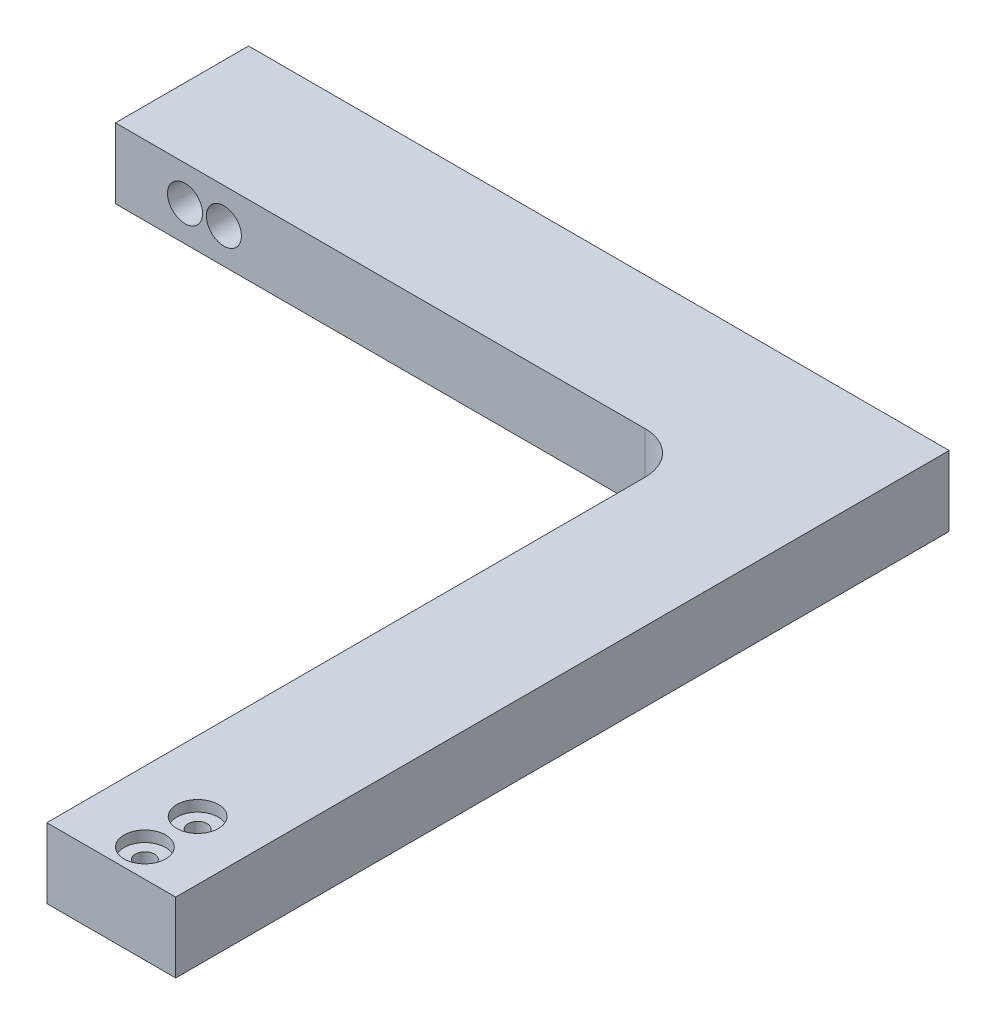
ISO-10303-21;
HEADER;
FILE_DESCRIPTION(('STEP AP214'),'2;1');
FILE_NAME('part.step','',(''),(''),'','','');
FILE_SCHEMA(('AUTOMOTIVE_DESIGN { 1 0 10303 214 1 1 1 1 }'));
ENDSEC;
DATA;
#1=APPLICATION_CONTEXT('core data for automotive mechanical design processes');
#2=APPLICATION_PROTOCOL_DEFINITION('international standard','automotive_design',2000,#1);
#3=PRODUCT_CONTEXT('',#1,'mechanical');
#4=PRODUCT('Part','Part','',(#3));
#5=PRODUCT_RELATED_PRODUCT_CATEGORY('part','',(#4));
#6=PRODUCT_DEFINITION_FORMATION('','',#4);
#7=PRODUCT_DEFINITION_CONTEXT('part definition',#1,'design');
#8=PRODUCT_DEFINITION('design','',#6,#7);
#9=PRODUCT_DEFINITION_SHAPE('','',#8);
#10=(LENGTH_UNIT() NAMED_UNIT(*) SI_UNIT(.MILLI.,.METRE.));
#11=(NAMED_UNIT(*) PLANE_ANGLE_UNIT() SI_UNIT($,.RADIAN.));
#12=(NAMED_UNIT(*) SI_UNIT($,.STERADIAN.) SOLID_ANGLE_UNIT());
#13=UNCERTAINTY_MEASURE_WITH_UNIT(LENGTH_MEASURE(1.E-05),#10,'distance_accuracy_value','');
#14=(GEOMETRIC_REPRESENTATION_CONTEXT(3) GLOBAL_UNCERTAINTY_ASSIGNED_CONTEXT((#13)) GLOBAL_UNIT_ASSIGNED_CONTEXT((#10,
#11,#12)) REPRESENTATION_CONTEXT('',''));
#15=CARTESIAN_POINT('',(0.,0.,0.));
#16=DIRECTION('',(0.,0.,1.));
#17=DIRECTION('',(1.,0.,0.));
#18=AXIS2_PLACEMENT_3D('',#15,#16,#17);
#19=CARTESIAN_POINT('',(10.668,12.7,-64.008));
#20=DIRECTION('',(-1.,0.,0.));
#21=DIRECTION('',(0.,0.,1.));
#22=AXIS2_PLACEMENT_3D('',#19,#20,#21);
#23=PLANE('',#22);
#24=DIRECTION('',(0.,0.,-1.));
#25=VECTOR('',#24,1.);
#26=CARTESIAN_POINT('',(10.668,0.,-64.008));
#27=LINE('',#26,#25);
#28=CARTESIAN_POINT('',(10.668,0.,76.2000000000001));
#29=VERTEX_POINT('',#28);
#30=CARTESIAN_POINT('',(10.668,0.,-64.008));
#31=VERTEX_POINT('',#30);
#32=EDGE_CURVE('E115',#29,#31,#27,.T.);
#33=ORIENTED_EDGE('',*,*,#32,.T.);
#34=DIRECTION('',(0.,-1.,0.));
#35=VECTOR('',#34,1.);
#36=CARTESIAN_POINT('',(10.668,12.7,-64.008));
#37=LINE('',#36,#35);
#38=CARTESIAN_POINT('',(10.668,12.7,-64.008));
#39=VERTEX_POINT('',#38);
#40=EDGE_CURVE('E96',#39,#31,#37,.T.);
#41=ORIENTED_EDGE('',*,*,#40,.F.);
#42=DIRECTION('',(0.,0.,-1.));
#43=VECTOR('',#42,1.);
#44=CARTESIAN_POINT('',(10.668,12.7,-64.008));
#45=LINE('',#44,#43);
#46=CARTESIAN_POINT('',(10.668,12.7,76.2000000000001));
#47=VERTEX_POINT('',#46);
#48=EDGE_CURVE('E103',#47,#39,#45,.T.);
#49=ORIENTED_EDGE('',*,*,#48,.F.);
#50=DIRECTION('',(0.,-1.,0.));
#51=VECTOR('',#50,1.);
#52=CARTESIAN_POINT('',(10.668,12.7,76.2000000000001));
#53=LINE('',#52,#51);
#54=EDGE_CURVE('E129',#47,#29,#53,.T.);
#55=ORIENTED_EDGE('',*,*,#54,.T.);
#56=EDGE_LOOP('',(#33,#41,#49,#55));
#57=FACE_BOUND('',#56,.T.);
#58=ADVANCED_FACE('F33',(#57),#23,.F.);
#59=CARTESIAN_POINT('',(10.668,12.7,-64.008));
#60=DIRECTION('',(0.,0.,1.));
#61=DIRECTION('',(1.,0.,0.));
#62=AXIS2_PLACEMENT_3D('',#59,#60,#61);
#63=PLANE('',#62);
#64=CARTESIAN_POINT('',(-103.71820388725,6.35,-64.008));
#65=DIRECTION('',(0.,0.,-1.));
#66=DIRECTION('',(-1.,0.,0.));
#67=AXIS2_PLACEMENT_3D('',#64,#65,#66);
#68=CIRCLE('',#67,3.17499999999998);
#69=CARTESIAN_POINT('',(-106.89320388725,6.35,-64.008));
#70=VERTEX_POINT('',#69);
#71=EDGE_CURVE('E180',#70,#70,#68,.T.);
#72=ORIENTED_EDGE('',*,*,#71,.F.);
#73=EDGE_LOOP('',(#72));
#74=FACE_BOUND('',#73,.T.);
#75=CARTESIAN_POINT('',(-96.6727548070736,6.35,-64.008));
#76=DIRECTION('',(0.,0.,-1.));
#77=DIRECTION('',(-1.,0.,0.));
#78=AXIS2_PLACEMENT_3D('',#75,#76,#77);
#79=CIRCLE('',#78,3.17499999999998);
#80=CARTESIAN_POINT('',(-99.8477548070736,6.35,-64.008));
#81=VERTEX_POINT('',#80);
#82=EDGE_CURVE('E174',#81,#81,#79,.T.);
#83=ORIENTED_EDGE('',*,*,#82,.F.);
#84=EDGE_LOOP('',(#83));
#85=FACE_BOUND('',#84,.T.);
#86=DIRECTION('',(-1.,0.,0.));
#87=VECTOR('',#86,1.);
#88=CARTESIAN_POINT('',(10.668,0.,-64.008));
#89=LINE('',#88,#87);
#90=CARTESIAN_POINT('',(-116.332,0.,-64.008));
#91=VERTEX_POINT('',#90);
#92=EDGE_CURVE('E138',#31,#91,#89,.T.);
#93=ORIENTED_EDGE('',*,*,#92,.T.);
#94=DIRECTION('',(0.,-1.,0.));
#95=VECTOR('',#94,1.);
#96=CARTESIAN_POINT('',(-116.332,12.7,-64.008));
#97=LINE('',#96,#95);
#98=CARTESIAN_POINT('',(-116.332,12.7,-64.008));
#99=VERTEX_POINT('',#98);
#100=EDGE_CURVE('E99',#99,#91,#97,.T.);
#101=ORIENTED_EDGE('',*,*,#100,.F.);
#102=DIRECTION('',(-1.,0.,0.));
#103=VECTOR('',#102,1.);
#104=CARTESIAN_POINT('',(10.668,12.7,-64.008));
#105=LINE('',#104,#103);
#106=EDGE_CURVE('E92',#39,#99,#105,.T.);
#107=ORIENTED_EDGE('',*,*,#106,.F.);
#108=ORIENTED_EDGE('',*,*,#40,.T.);
#109=EDGE_LOOP('',(#93,#101,#107,#108));
#110=FACE_BOUND('',#109,.T.);
#111=ADVANCED_FACE('F94',(#74,#85,#110),#63,.F.);
#112=CARTESIAN_POINT('',(-116.332,12.7,-64.008));
#113=DIRECTION('',(1.,0.,0.));
#114=DIRECTION('',(0.,0.,-1.));
#115=AXIS2_PLACEMENT_3D('',#112,#113,#114);
#116=PLANE('',#115);
#117=DIRECTION('',(0.,0.,1.));
#118=VECTOR('',#117,1.);
#119=CARTESIAN_POINT('',(-116.332,0.,-64.008));
#120=LINE('',#119,#118);
#121=CARTESIAN_POINT('',(-116.332,0.,-39.878));
#122=VERTEX_POINT('',#121);
#123=EDGE_CURVE('E136',#91,#122,#120,.T.);
#124=ORIENTED_EDGE('',*,*,#123,.T.);
#125=DIRECTION('',(0.,-1.,0.));
#126=VECTOR('',#125,1.);
#127=CARTESIAN_POINT('',(-116.332,12.7,-39.878));
#128=LINE('',#127,#126);
#129=CARTESIAN_POINT('',(-116.332,12.7,-39.878));
#130=VERTEX_POINT('',#129);
#131=EDGE_CURVE('E120',#130,#122,#128,.T.);
#132=ORIENTED_EDGE('',*,*,#131,.F.);
#133=DIRECTION('',(0.,0.,1.));
#134=VECTOR('',#133,1.);
#135=CARTESIAN_POINT('',(-116.332,12.7,-64.008));
#136=LINE('',#135,#134);
#137=EDGE_CURVE('E102',#99,#130,#136,.T.);
#138=ORIENTED_EDGE('',*,*,#137,.F.);
#139=ORIENTED_EDGE('',*,*,#100,.T.);
#140=EDGE_LOOP('',(#124,#132,#138,#139));
#141=FACE_BOUND('',#140,.T.);
#142=ADVANCED_FACE('F188',(#141),#116,.F.);
#143=CARTESIAN_POINT('',(-12.7,12.7,-39.878));
#144=DIRECTION('',(0.,0.,-1.));
#145=DIRECTION('',(-1.,0.,0.));
#146=AXIS2_PLACEMENT_3D('',#143,#144,#145);
#147=PLANE('',#146);
#148=CARTESIAN_POINT('',(-103.71820388725,6.35,-39.878));
#149=DIRECTION('',(0.,0.,-1.));
#150=DIRECTION('',(-1.,0.,0.));
#151=AXIS2_PLACEMENT_3D('',#148,#149,#150);
#152=CIRCLE('',#151,3.17499999999999);
#153=CARTESIAN_POINT('',(-106.89320388725,6.35,-39.878));
#154=VERTEX_POINT('',#153);
#155=EDGE_CURVE('E177',#154,#154,#152,.T.);
#156=ORIENTED_EDGE('',*,*,#155,.T.);
#157=EDGE_LOOP('',(#156));
#158=FACE_BOUND('',#157,.T.);
#159=CARTESIAN_POINT('',(-96.6727548070736,6.35,-39.878));
#160=DIRECTION('',(0.,0.,-1.));
#161=DIRECTION('',(-1.,0.,0.));
#162=AXIS2_PLACEMENT_3D('',#159,#160,#161);
#163=CIRCLE('',#162,3.17499999999999);
#164=CARTESIAN_POINT('',(-99.8477548070736,6.35,-39.878));
#165=VERTEX_POINT('',#164);
#166=EDGE_CURVE('E171',#165,#165,#163,.T.);
#167=ORIENTED_EDGE('',*,*,#166,.T.);
#168=EDGE_LOOP('',(#167));
#169=FACE_BOUND('',#168,.T.);
#170=DIRECTION('',(1.,0.,0.));
#171=VECTOR('',#170,1.);
#172=CARTESIAN_POINT('',(-12.7,0.,-39.878));
#173=LINE('',#172,#171);
#174=CARTESIAN_POINT('',(-20.32,0.,-39.878));
#175=VERTEX_POINT('',#174);
#176=EDGE_CURVE('E134',#122,#175,#173,.T.);
#177=ORIENTED_EDGE('',*,*,#176,.T.);
#178=DIRECTION('',(0.,-1.,0.));
#179=VECTOR('',#178,1.);
#180=CARTESIAN_POINT('',(-20.32,12.7,-39.878));
#181=LINE('',#180,#179);
#182=CARTESIAN_POINT('',(-20.32,12.7,-39.878));
#183=VERTEX_POINT('',#182);
#184=EDGE_CURVE('E48',#175,#183,#181,.F.);
#185=ORIENTED_EDGE('',*,*,#184,.T.);
#186=DIRECTION('',(1.,0.,0.));
#187=VECTOR('',#186,1.);
#188=CARTESIAN_POINT('',(-12.7,12.7,-39.878));
#189=LINE('',#188,#187);
#190=EDGE_CURVE('E145',#130,#183,#189,.T.);
#191=ORIENTED_EDGE('',*,*,#190,.F.);
#192=ORIENTED_EDGE('',*,*,#131,.T.);
#193=EDGE_LOOP('',(#177,#185,#191,#192));
#194=FACE_BOUND('',#193,.T.);
#195=ADVANCED_FACE('F213',(#158,#169,#194),#147,.F.);
#196=CARTESIAN_POINT('',(-12.7,12.7,-39.878));
#197=DIRECTION('',(1.,0.,0.));
#198=DIRECTION('',(0.,0.,-1.));
#199=AXIS2_PLACEMENT_3D('',#196,#197,#198);
#200=PLANE('',#199);
#201=DIRECTION('',(0.,0.,1.));
#202=VECTOR('',#201,1.);
#203=CARTESIAN_POINT('',(-12.7,12.7,-39.878));
#204=LINE('',#203,#202);
#205=CARTESIAN_POINT('',(-12.7,12.7,-32.258));
#206=VERTEX_POINT('',#205);
#207=CARTESIAN_POINT('',(-12.7,12.7,76.2000000000001));
#208=VERTEX_POINT('',#207);
#209=EDGE_CURVE('E143',#206,#208,#204,.T.);
#210=ORIENTED_EDGE('',*,*,#209,.F.);
#211=DIRECTION('',(0.,-1.,0.));
#212=VECTOR('',#211,1.);
#213=CARTESIAN_POINT('',(-12.7,0.,-32.258));
#214=LINE('',#213,#212);
#215=CARTESIAN_POINT('',(-12.7,0.,-32.258));
#216=VERTEX_POINT('',#215);
#217=EDGE_CURVE('E116',#206,#216,#214,.T.);
#218=ORIENTED_EDGE('',*,*,#217,.T.);
#219=DIRECTION('',(0.,0.,1.));
#220=VECTOR('',#219,1.);
#221=CARTESIAN_POINT('',(-12.7,0.,-39.878));
#222=LINE('',#221,#220);
#223=CARTESIAN_POINT('',(-12.7,0.,76.2000000000001));
#224=VERTEX_POINT('',#223);
#225=EDGE_CURVE('E132',#216,#224,#222,.T.);
#226=ORIENTED_EDGE('',*,*,#225,.T.);
#227=DIRECTION('',(0.,-1.,0.));
#228=VECTOR('',#227,1.);
#229=CARTESIAN_POINT('',(-12.7,12.7,76.2000000000001));
#230=LINE('',#229,#228);
#231=EDGE_CURVE('E126',#208,#224,#230,.T.);
#232=ORIENTED_EDGE('',*,*,#231,.F.);
#233=EDGE_LOOP('',(#210,#218,#226,#232));
#234=FACE_BOUND('',#233,.T.);
#235=ADVANCED_FACE('F217',(#234),#200,.F.);
#236=CARTESIAN_POINT('',(-12.7,12.7,76.2000000000001));
#237=DIRECTION('',(0.,0.,-1.));
#238=DIRECTION('',(-1.,0.,0.));
#239=AXIS2_PLACEMENT_3D('',#236,#237,#238);
#240=PLANE('',#239);
#241=DIRECTION('',(1.,0.,0.));
#242=VECTOR('',#241,1.);
#243=CARTESIAN_POINT('',(-12.7,0.,76.2000000000001));
#244=LINE('',#243,#242);
#245=EDGE_CURVE('E112',#224,#29,#244,.T.);
#246=ORIENTED_EDGE('',*,*,#245,.T.);
#247=ORIENTED_EDGE('',*,*,#54,.F.);
#248=DIRECTION('',(1.,0.,0.));
#249=VECTOR('',#248,1.);
#250=CARTESIAN_POINT('',(-12.7,12.7,76.2000000000001));
#251=LINE('',#250,#249);
#252=EDGE_CURVE('E108',#208,#47,#251,.T.);
#253=ORIENTED_EDGE('',*,*,#252,.F.);
#254=ORIENTED_EDGE('',*,*,#231,.T.);
#255=EDGE_LOOP('',(#246,#247,#253,#254));
#256=FACE_BOUND('',#255,.T.);
#257=ADVANCED_FACE('F221',(#256),#240,.F.);
#258=CARTESIAN_POINT('',(0.,12.7,0.));
#259=DIRECTION('',(0.,1.,0.));
#260=DIRECTION('',(0.,0.,1.));
#261=AXIS2_PLACEMENT_3D('',#258,#259,#260);
#262=PLANE('',#261);
#263=CARTESIAN_POINT('',(0.,12.7,71.1200000000001));
#264=DIRECTION('',(0.,1.,0.));
#265=DIRECTION('',(0.,0.,1.));
#266=AXIS2_PLACEMENT_3D('',#263,#264,#265);
#267=CIRCLE('',#266,3.77063);
#268=CARTESIAN_POINT('',(0.,12.7,74.8906300000001));
#269=VERTEX_POINT('',#268);
#270=EDGE_CURVE('E168',#269,#269,#267,.T.);
#271=ORIENTED_EDGE('',*,*,#270,.F.);
#272=EDGE_LOOP('',(#271));
#273=FACE_BOUND('',#272,.T.);
#274=CARTESIAN_POINT('',(0.,12.7,61.5608905791934));
#275=DIRECTION('',(0.,1.,0.));
#276=DIRECTION('',(0.,0.,1.));
#277=AXIS2_PLACEMENT_3D('',#274,#275,#276);
#278=CIRCLE('',#277,3.77063);
#279=CARTESIAN_POINT('',(0.,12.7,65.3315205791934));
#280=VERTEX_POINT('',#279);
#281=EDGE_CURVE('E156',#280,#280,#278,.T.);
#282=ORIENTED_EDGE('',*,*,#281,.F.);
#283=EDGE_LOOP('',(#282));
#284=FACE_BOUND('',#283,.T.);
#285=ORIENTED_EDGE('',*,*,#48,.T.);
#286=ORIENTED_EDGE('',*,*,#106,.T.);
#287=ORIENTED_EDGE('',*,*,#137,.T.);
#288=ORIENTED_EDGE('',*,*,#190,.T.);
#289=CARTESIAN_POINT('',(-20.32,12.7,-32.258));
#290=DIRECTION('',(0.,1.,0.));
#291=DIRECTION('',(0.,0.,1.));
#292=AXIS2_PLACEMENT_3D('',#289,#290,#291);
#293=CIRCLE('',#292,7.62);
#294=EDGE_CURVE('E11',#183,#206,#293,.F.);
#295=ORIENTED_EDGE('',*,*,#294,.T.);
#296=ORIENTED_EDGE('',*,*,#209,.T.);
#297=ORIENTED_EDGE('',*,*,#252,.T.);
#298=EDGE_LOOP('',(#285,#286,#287,#288,#295,#296,#297));
#299=FACE_BOUND('',#298,.T.);
#300=ADVANCED_FACE('F106',(#273,#284,#299),#262,.T.);
#301=CARTESIAN_POINT('',(0.,0.,0.));
#302=DIRECTION('',(0.,1.,0.));
#303=DIRECTION('',(0.,0.,1.));
#304=AXIS2_PLACEMENT_3D('',#301,#302,#303);
#305=PLANE('',#304);
#306=CARTESIAN_POINT('',(0.,0.,71.1200000000001));
#307=DIRECTION('',(0.,1.,0.));
#308=DIRECTION('',(0.,0.,1.));
#309=AXIS2_PLACEMENT_3D('',#306,#307,#308);
#310=CIRCLE('',#309,1.7272);
#311=CARTESIAN_POINT('',(0.,0.,72.8472000000001));
#312=VERTEX_POINT('',#311);
#313=EDGE_CURVE('E159',#312,#312,#310,.T.);
#314=ORIENTED_EDGE('',*,*,#313,.T.);
#315=EDGE_LOOP('',(#314));
#316=FACE_BOUND('',#315,.T.);
#317=CARTESIAN_POINT('',(0.,0.,61.5608905791934));
#318=DIRECTION('',(0.,1.,0.));
#319=DIRECTION('',(0.,0.,1.));
#320=AXIS2_PLACEMENT_3D('',#317,#318,#319);
#321=CIRCLE('',#320,1.7272);
#322=CARTESIAN_POINT('',(0.,0.,63.2880905791934));
#323=VERTEX_POINT('',#322);
#324=EDGE_CURVE('E141',#323,#323,#321,.T.);
#325=ORIENTED_EDGE('',*,*,#324,.T.);
#326=EDGE_LOOP('',(#325));
#327=FACE_BOUND('',#326,.T.);
#328=ORIENTED_EDGE('',*,*,#32,.F.);
#329=ORIENTED_EDGE('',*,*,#245,.F.);
#330=ORIENTED_EDGE('',*,*,#225,.F.);
#331=CARTESIAN_POINT('',(-20.32,0.,-32.258));
#332=DIRECTION('',(0.,1.,0.));
#333=DIRECTION('',(0.,0.,1.));
#334=AXIS2_PLACEMENT_3D('',#331,#332,#333);
#335=CIRCLE('',#334,7.62);
#336=EDGE_CURVE('E41',#216,#175,#335,.T.);
#337=ORIENTED_EDGE('',*,*,#336,.T.);
#338=ORIENTED_EDGE('',*,*,#176,.F.);
#339=ORIENTED_EDGE('',*,*,#123,.F.);
#340=ORIENTED_EDGE('',*,*,#92,.F.);
#341=EDGE_LOOP('',(#328,#329,#330,#337,#338,#339,#340));
#342=FACE_BOUND('',#341,.T.);
#343=ADVANCED_FACE('F226',(#316,#327,#342),#305,.F.);
#344=CARTESIAN_POINT('',(-20.32,12.7,-32.258));
#345=DIRECTION('',(0.,1.,0.));
#346=DIRECTION('',(0.,0.,1.));
#347=AXIS2_PLACEMENT_3D('',#344,#345,#346);
#348=CYLINDRICAL_SURFACE('',#347,7.62);
#349=ORIENTED_EDGE('',*,*,#294,.F.);
#350=ORIENTED_EDGE('',*,*,#184,.F.);
#351=ORIENTED_EDGE('',*,*,#336,.F.);
#352=ORIENTED_EDGE('',*,*,#217,.F.);
#353=EDGE_LOOP('',(#349,#350,#351,#352));
#354=FACE_BOUND('',#353,.T.);
#355=ADVANCED_FACE('F35',(#354),#348,.F.);
#356=CARTESIAN_POINT('',(0.,12.7,61.5608905791934));
#357=DIRECTION('',(0.,1.,0.));
#358=DIRECTION('',(0.,0.,1.));
#359=AXIS2_PLACEMENT_3D('',#356,#357,#358);
#360=CYLINDRICAL_SURFACE('',#359,1.7272);
#361=ORIENTED_EDGE('',*,*,#324,.F.);
#362=EDGE_LOOP('',(#361));
#363=FACE_BOUND('',#362,.T.);
#364=CARTESIAN_POINT('',(0.,10.7188,61.5608905791934));
#365=DIRECTION('',(0.,1.,0.));
#366=DIRECTION('',(0.,0.,1.));
#367=AXIS2_PLACEMENT_3D('',#364,#365,#366);
#368=CIRCLE('',#367,1.7272);
#369=CARTESIAN_POINT('',(0.,10.7188,63.2880905791934));
#370=VERTEX_POINT('',#369);
#371=EDGE_CURVE('E150',#370,#370,#368,.T.);
#372=ORIENTED_EDGE('',*,*,#371,.T.);
#373=EDGE_LOOP('',(#372));
#374=FACE_BOUND('',#373,.T.);
#375=ADVANCED_FACE('F233',(#363,#374),#360,.F.);
#376=CARTESIAN_POINT('',(1.7272,10.7188,61.5608905791934));
#377=DIRECTION('',(0.,-1.,0.));
#378=DIRECTION('',(0.,0.,-1.));
#379=AXIS2_PLACEMENT_3D('',#376,#377,#378);
#380=PLANE('',#379);
#381=ORIENTED_EDGE('',*,*,#371,.F.);
#382=EDGE_LOOP('',(#381));
#383=FACE_BOUND('',#382,.T.);
#384=CARTESIAN_POINT('',(0.,10.7188,61.5608905791934));
#385=DIRECTION('',(0.,1.,0.));
#386=DIRECTION('',(0.,0.,1.));
#387=AXIS2_PLACEMENT_3D('',#384,#385,#386);
#388=CIRCLE('',#387,3.77063);
#389=CARTESIAN_POINT('',(0.,10.7188,65.3315205791934));
#390=VERTEX_POINT('',#389);
#391=EDGE_CURVE('E153',#390,#390,#388,.T.);
#392=ORIENTED_EDGE('',*,*,#391,.T.);
#393=EDGE_LOOP('',(#392));
#394=FACE_BOUND('',#393,.T.);
#395=ADVANCED_FACE('F236',(#383,#394),#380,.F.);
#396=CARTESIAN_POINT('',(0.,12.7,61.5608905791934));
#397=DIRECTION('',(0.,1.,0.));
#398=DIRECTION('',(0.,0.,1.));
#399=AXIS2_PLACEMENT_3D('',#396,#397,#398);
#400=CYLINDRICAL_SURFACE('',#399,3.77063);
#401=ORIENTED_EDGE('',*,*,#391,.F.);
#402=EDGE_LOOP('',(#401));
#403=FACE_BOUND('',#402,.T.);
#404=ORIENTED_EDGE('',*,*,#281,.T.);
#405=EDGE_LOOP('',(#404));
#406=FACE_BOUND('',#405,.T.);
#407=ADVANCED_FACE('F240',(#403,#406),#400,.F.);
#408=CARTESIAN_POINT('',(0.,12.7,71.1200000000001));
#409=DIRECTION('',(0.,1.,0.));
#410=DIRECTION('',(0.,0.,1.));
#411=AXIS2_PLACEMENT_3D('',#408,#409,#410);
#412=CYLINDRICAL_SURFACE('',#411,1.7272);
#413=ORIENTED_EDGE('',*,*,#313,.F.);
#414=EDGE_LOOP('',(#413));
#415=FACE_BOUND('',#414,.T.);
#416=CARTESIAN_POINT('',(0.,10.7188,71.1200000000001));
#417=DIRECTION('',(0.,1.,0.));
#418=DIRECTION('',(0.,0.,1.));
#419=AXIS2_PLACEMENT_3D('',#416,#417,#418);
#420=CIRCLE('',#419,1.7272);
#421=CARTESIAN_POINT('',(0.,10.7188,72.8472000000001));
#422=VERTEX_POINT('',#421);
#423=EDGE_CURVE('E162',#422,#422,#420,.T.);
#424=ORIENTED_EDGE('',*,*,#423,.T.);
#425=EDGE_LOOP('',(#424));
#426=FACE_BOUND('',#425,.T.);
#427=ADVANCED_FACE('F244',(#415,#426),#412,.F.);
#428=CARTESIAN_POINT('',(1.7272,10.7188,71.1200000000001));
#429=DIRECTION('',(0.,-1.,0.));
#430=DIRECTION('',(0.,0.,-1.));
#431=AXIS2_PLACEMENT_3D('',#428,#429,#430);
#432=PLANE('',#431);
#433=ORIENTED_EDGE('',*,*,#423,.F.);
#434=EDGE_LOOP('',(#433));
#435=FACE_BOUND('',#434,.T.);
#436=CARTESIAN_POINT('',(0.,10.7188,71.1200000000001));
#437=DIRECTION('',(0.,1.,0.));
#438=DIRECTION('',(0.,0.,1.));
#439=AXIS2_PLACEMENT_3D('',#436,#437,#438);
#440=CIRCLE('',#439,3.77063);
#441=CARTESIAN_POINT('',(0.,10.7188,74.8906300000001));
#442=VERTEX_POINT('',#441);
#443=EDGE_CURVE('E165',#442,#442,#440,.T.);
#444=ORIENTED_EDGE('',*,*,#443,.T.);
#445=EDGE_LOOP('',(#444));
#446=FACE_BOUND('',#445,.T.);
#447=ADVANCED_FACE('F203',(#435,#446),#432,.F.);
#448=CARTESIAN_POINT('',(0.,12.7,71.1200000000001));
#449=DIRECTION('',(0.,1.,0.));
#450=DIRECTION('',(0.,0.,1.));
#451=AXIS2_PLACEMENT_3D('',#448,#449,#450);
#452=CYLINDRICAL_SURFACE('',#451,3.77063);
#453=ORIENTED_EDGE('',*,*,#443,.F.);
#454=EDGE_LOOP('',(#453));
#455=FACE_BOUND('',#454,.T.);
#456=ORIENTED_EDGE('',*,*,#270,.T.);
#457=EDGE_LOOP('',(#456));
#458=FACE_BOUND('',#457,.T.);
#459=ADVANCED_FACE('F194',(#455,#458),#452,.F.);
#460=CARTESIAN_POINT('',(-96.6727548070736,6.35,-64.008));
#461=DIRECTION('',(0.,0.,-1.));
#462=DIRECTION('',(-1.,0.,0.));
#463=AXIS2_PLACEMENT_3D('',#460,#461,#462);
#464=CYLINDRICAL_SURFACE('',#463,3.17499999999999);
#465=ORIENTED_EDGE('',*,*,#166,.F.);
#466=EDGE_LOOP('',(#465));
#467=FACE_BOUND('',#466,.T.);
#468=ORIENTED_EDGE('',*,*,#82,.T.);
#469=EDGE_LOOP('',(#468));
#470=FACE_BOUND('',#469,.T.);
#471=ADVANCED_FACE('F192',(#467,#470),#464,.F.);
#472=CARTESIAN_POINT('',(-103.71820388725,6.35,-64.008));
#473=DIRECTION('',(0.,0.,-1.));
#474=DIRECTION('',(-1.,0.,0.));
#475=AXIS2_PLACEMENT_3D('',#472,#473,#474);
#476=CYLINDRICAL_SURFACE('',#475,3.17499999999999);
#477=ORIENTED_EDGE('',*,*,#155,.F.);
#478=EDGE_LOOP('',(#477));
#479=FACE_BOUND('',#478,.T.);
#480=ORIENTED_EDGE('',*,*,#71,.T.);
#481=EDGE_LOOP('',(#480));
#482=FACE_BOUND('',#481,.T.);
#483=ADVANCED_FACE('F184',(#479,#482),#476,.F.);
#484=CLOSED_SHELL('',(#58,#111,#142,#195,#235,#257,#300,#343,#355,#375,#395,#407,#427,#447,#459,
#471,#483));
#485=MANIFOLD_SOLID_BREP('B2',#484);
#486=ADVANCED_BREP_SHAPE_REPRESENTATION('',(#18,#485),#14);
#487=SHAPE_DEFINITION_REPRESENTATION(#9,#486);
ENDSEC;
END-ISO-10303-21;
